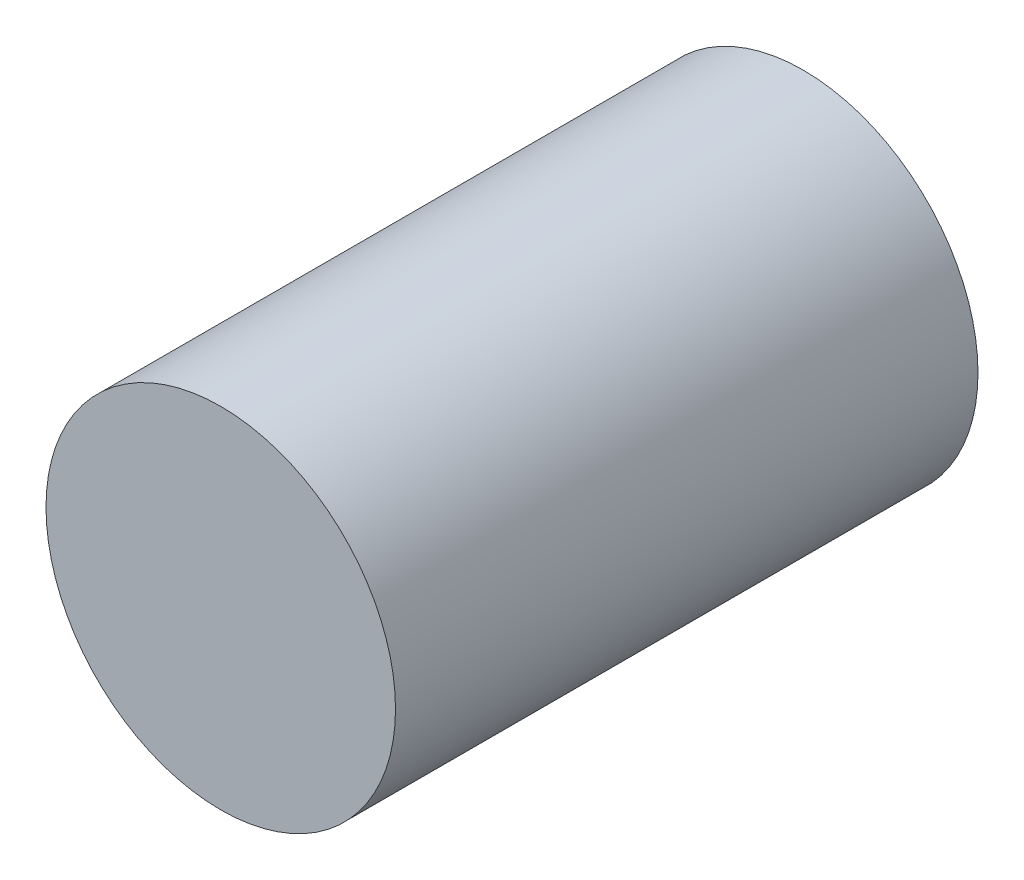
ISO-10303-21;
HEADER;
FILE_DESCRIPTION(('STEP AP214'),'2;1');
FILE_NAME('part.step','',(''),(''),'','','');
FILE_SCHEMA(('AUTOMOTIVE_DESIGN { 1 0 10303 214 1 1 1 1 }'));
ENDSEC;
DATA;
#1=APPLICATION_CONTEXT('core data for automotive mechanical design processes');
#2=APPLICATION_PROTOCOL_DEFINITION('international standard','automotive_design',2000,#1);
#3=PRODUCT_CONTEXT('',#1,'mechanical');
#4=PRODUCT('Part','Part','',(#3));
#5=PRODUCT_RELATED_PRODUCT_CATEGORY('part','',(#4));
#6=PRODUCT_DEFINITION_FORMATION('','',#4);
#7=PRODUCT_DEFINITION_CONTEXT('part definition',#1,'design');
#8=PRODUCT_DEFINITION('design','',#6,#7);
#9=PRODUCT_DEFINITION_SHAPE('','',#8);
#10=(LENGTH_UNIT() NAMED_UNIT(*) SI_UNIT(.MILLI.,.METRE.));
#11=(NAMED_UNIT(*) PLANE_ANGLE_UNIT() SI_UNIT($,.RADIAN.));
#12=(NAMED_UNIT(*) SI_UNIT($,.STERADIAN.) SOLID_ANGLE_UNIT());
#13=UNCERTAINTY_MEASURE_WITH_UNIT(LENGTH_MEASURE(1.E-05),#10,'distance_accuracy_value','');
#14=(GEOMETRIC_REPRESENTATION_CONTEXT(3) GLOBAL_UNCERTAINTY_ASSIGNED_CONTEXT((#13)) GLOBAL_UNIT_ASSIGNED_CONTEXT((#10,
#11,#12)) REPRESENTATION_CONTEXT('',''));
#15=CARTESIAN_POINT('',(0.,0.,0.));
#16=DIRECTION('',(0.,0.,1.));
#17=DIRECTION('',(1.,0.,0.));
#18=AXIS2_PLACEMENT_3D('',#15,#16,#17);
#19=CARTESIAN_POINT('',(1.55428571428573,0.,1.));
#20=DIRECTION('',(0.,0.,-1.));
#21=DIRECTION('',(-1.,0.,0.));
#22=AXIS2_PLACEMENT_3D('',#19,#20,#21);
#23=CYLINDRICAL_SURFACE('',#22,0.3);
#24=CARTESIAN_POINT('',(1.55428571428573,0.,1.));
#25=DIRECTION('',(0.,0.,1.));
#26=DIRECTION('',(1.,0.,0.));
#27=AXIS2_PLACEMENT_3D('',#24,#25,#26);
#28=CIRCLE('',#27,0.3);
#29=CARTESIAN_POINT('',(1.85428571428573,0.,1.));
#30=VERTEX_POINT('',#29);
#31=EDGE_CURVE('E10',#30,#30,#28,.T.);
#32=ORIENTED_EDGE('',*,*,#31,.F.);
#33=EDGE_LOOP('',(#32));
#34=FACE_BOUND('',#33,.T.);
#35=CARTESIAN_POINT('',(1.55428571428573,0.,0.));
#36=DIRECTION('',(0.,0.,1.));
#37=DIRECTION('',(1.,0.,0.));
#38=AXIS2_PLACEMENT_3D('',#35,#36,#37);
#39=CIRCLE('',#38,0.3);
#40=CARTESIAN_POINT('',(1.85428571428573,0.,0.));
#41=VERTEX_POINT('',#40);
#42=EDGE_CURVE('E35',#41,#41,#39,.T.);
#43=ORIENTED_EDGE('',*,*,#42,.T.);
#44=EDGE_LOOP('',(#43));
#45=FACE_BOUND('',#44,.T.);
#46=ADVANCED_FACE('F32',(#34,#45),#23,.T.);
#47=CARTESIAN_POINT('',(1.55428571428573,0.,1.));
#48=DIRECTION('',(0.,0.,1.));
#49=DIRECTION('',(1.,0.,0.));
#50=AXIS2_PLACEMENT_3D('',#47,#48,#49);
#51=PLANE('',#50);
#52=ORIENTED_EDGE('',*,*,#31,.T.);
#53=EDGE_LOOP('',(#52));
#54=FACE_BOUND('',#53,.T.);
#55=ADVANCED_FACE('F47',(#54),#51,.T.);
#56=CARTESIAN_POINT('',(1.55428571428573,0.,0.));
#57=DIRECTION('',(0.,0.,1.));
#58=DIRECTION('',(1.,0.,0.));
#59=AXIS2_PLACEMENT_3D('',#56,#57,#58);
#60=PLANE('',#59);
#61=ORIENTED_EDGE('',*,*,#42,.F.);
#62=EDGE_LOOP('',(#61));
#63=FACE_BOUND('',#62,.T.);
#64=ADVANCED_FACE('F45',(#63),#60,.F.);
#65=CLOSED_SHELL('',(#46,#55,#64));
#66=MANIFOLD_SOLID_BREP('B2',#65);
#67=ADVANCED_BREP_SHAPE_REPRESENTATION('',(#18,#66),#14);
#68=SHAPE_DEFINITION_REPRESENTATION(#9,#67);
ENDSEC;
END-ISO-10303-21;
